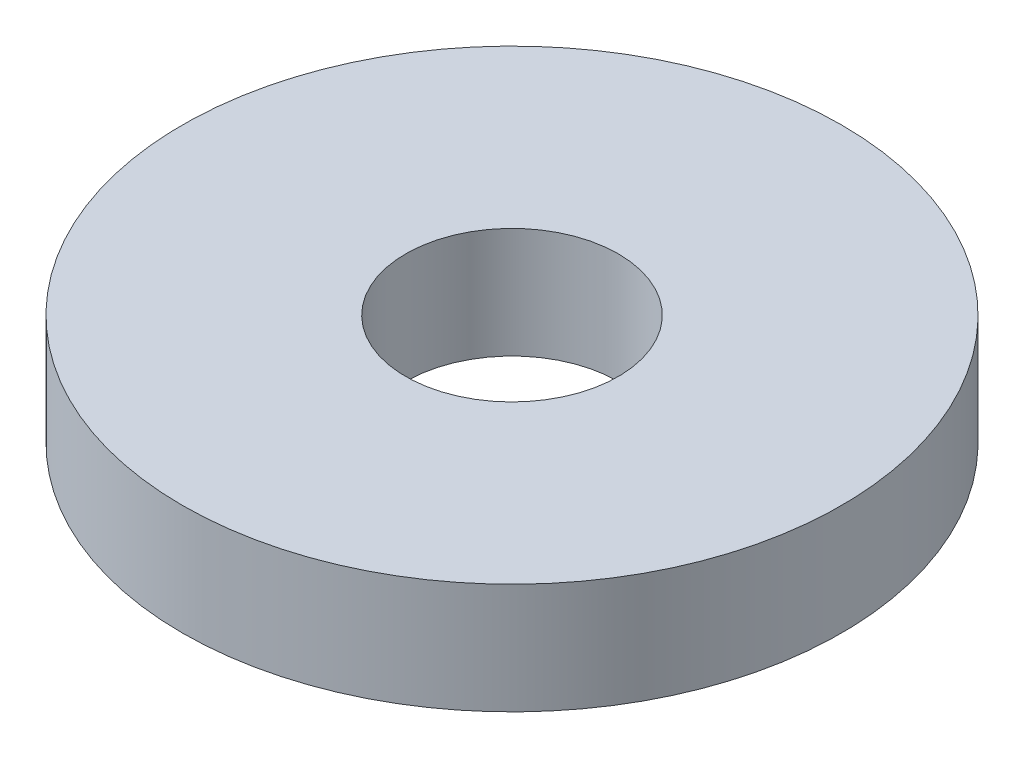
ISO-10303-21;
HEADER;
FILE_DESCRIPTION(('STEP AP214'),'2;1');
FILE_NAME('part.step','',(''),(''),'','','');
FILE_SCHEMA(('AUTOMOTIVE_DESIGN { 1 0 10303 214 1 1 1 1 }'));
ENDSEC;
DATA;
#1=APPLICATION_CONTEXT('core data for automotive mechanical design processes');
#2=APPLICATION_PROTOCOL_DEFINITION('international standard','automotive_design',2000,#1);
#3=PRODUCT_CONTEXT('',#1,'mechanical');
#4=PRODUCT('Part','Part','',(#3));
#5=PRODUCT_RELATED_PRODUCT_CATEGORY('part','',(#4));
#6=PRODUCT_DEFINITION_FORMATION('','',#4);
#7=PRODUCT_DEFINITION_CONTEXT('part definition',#1,'design');
#8=PRODUCT_DEFINITION('design','',#6,#7);
#9=PRODUCT_DEFINITION_SHAPE('','',#8);
#10=(LENGTH_UNIT() NAMED_UNIT(*) SI_UNIT(.MILLI.,.METRE.));
#11=(NAMED_UNIT(*) PLANE_ANGLE_UNIT() SI_UNIT($,.RADIAN.));
#12=(NAMED_UNIT(*) SI_UNIT($,.STERADIAN.) SOLID_ANGLE_UNIT());
#13=UNCERTAINTY_MEASURE_WITH_UNIT(LENGTH_MEASURE(1.E-05),#10,'distance_accuracy_value','');
#14=(GEOMETRIC_REPRESENTATION_CONTEXT(3) GLOBAL_UNCERTAINTY_ASSIGNED_CONTEXT((#13)) GLOBAL_UNIT_ASSIGNED_CONTEXT((#10,
#11,#12)) REPRESENTATION_CONTEXT('',''));
#15=CARTESIAN_POINT('',(0.,0.,0.));
#16=DIRECTION('',(0.,0.,1.));
#17=DIRECTION('',(1.,0.,0.));
#18=AXIS2_PLACEMENT_3D('',#15,#16,#17);
#19=CARTESIAN_POINT('',(0.,26.,0.));
#20=DIRECTION('',(0.,-1.,0.));
#21=DIRECTION('',(0.,0.,-1.));
#22=AXIS2_PLACEMENT_3D('',#19,#20,#21);
#23=CYLINDRICAL_SURFACE('',#22,77.5);
#24=CARTESIAN_POINT('',(0.,26.,0.));
#25=DIRECTION('',(0.,1.,0.));
#26=DIRECTION('',(0.,0.,1.));
#27=AXIS2_PLACEMENT_3D('',#24,#25,#26);
#28=CIRCLE('',#27,77.5);
#29=CARTESIAN_POINT('',(0.,26.,-77.5));
#30=VERTEX_POINT('',#29);
#31=EDGE_CURVE('E10',#30,#30,#28,.T.);
#32=CARTESIAN_POINT('',(0.,0.,0.));
#33=DIRECTION('',(0.,1.,0.));
#34=DIRECTION('',(0.,0.,1.));
#35=AXIS2_PLACEMENT_3D('',#32,#33,#34);
#36=CIRCLE('',#35,77.5);
#37=CARTESIAN_POINT('',(0.,0.,-77.5));
#38=VERTEX_POINT('',#37);
#39=EDGE_CURVE('E37',#38,#38,#36,.T.);
#40=CARTESIAN_POINT('',(0.,26.,-77.5));
#41=CARTESIAN_POINT('',(0.,25.7291666666667,-77.5));
#42=CARTESIAN_POINT('',(0.,25.4583333333333,-77.5));
#43=CARTESIAN_POINT('',(0.,24.9166666666667,-77.5));
#44=CARTESIAN_POINT('',(0.,24.6458333333333,-77.5));
#45=CARTESIAN_POINT('',(0.,24.1041666666667,-77.5));
#46=CARTESIAN_POINT('',(0.,23.8333333333333,-77.5));
#47=CARTESIAN_POINT('',(0.,23.2916666666667,-77.5));
#48=CARTESIAN_POINT('',(0.,23.0208333333333,-77.5));
#49=CARTESIAN_POINT('',(0.,22.4791666666667,-77.5));
#50=CARTESIAN_POINT('',(0.,22.2083333333333,-77.5));
#51=CARTESIAN_POINT('',(0.,21.6666666666667,-77.5));
#52=CARTESIAN_POINT('',(0.,21.3958333333333,-77.5));
#53=CARTESIAN_POINT('',(0.,20.8541666666667,-77.5));
#54=CARTESIAN_POINT('',(0.,20.5833333333333,-77.5));
#55=CARTESIAN_POINT('',(0.,20.0416666666667,-77.5));
#56=CARTESIAN_POINT('',(0.,19.7708333333333,-77.5));
#57=CARTESIAN_POINT('',(0.,19.2291666666667,-77.5));
#58=CARTESIAN_POINT('',(0.,18.9583333333333,-77.5));
#59=CARTESIAN_POINT('',(0.,18.4166666666667,-77.5));
#60=CARTESIAN_POINT('',(0.,18.1458333333333,-77.5));
#61=CARTESIAN_POINT('',(0.,17.6041666666667,-77.5));
#62=CARTESIAN_POINT('',(0.,17.3333333333333,-77.5));
#63=CARTESIAN_POINT('',(0.,16.7916666666667,-77.5));
#64=CARTESIAN_POINT('',(0.,16.5208333333333,-77.5));
#65=CARTESIAN_POINT('',(0.,15.9791666666667,-77.5));
#66=CARTESIAN_POINT('',(0.,15.7083333333333,-77.5));
#67=CARTESIAN_POINT('',(0.,15.1666666666667,-77.5));
#68=CARTESIAN_POINT('',(0.,14.8958333333333,-77.5));
#69=CARTESIAN_POINT('',(0.,14.3541666666667,-77.5));
#70=CARTESIAN_POINT('',(0.,14.0833333333333,-77.5));
#71=CARTESIAN_POINT('',(0.,13.5416666666667,-77.5));
#72=CARTESIAN_POINT('',(0.,13.2708333333333,-77.5));
#73=CARTESIAN_POINT('',(0.,12.7291666666667,-77.5));
#74=CARTESIAN_POINT('',(0.,12.4583333333333,-77.5));
#75=CARTESIAN_POINT('',(0.,11.9166666666667,-77.5));
#76=CARTESIAN_POINT('',(0.,11.6458333333333,-77.5));
#77=CARTESIAN_POINT('',(0.,11.1041666666667,-77.5));
#78=CARTESIAN_POINT('',(0.,10.8333333333333,-77.5));
#79=CARTESIAN_POINT('',(0.,10.2916666666667,-77.5));
#80=CARTESIAN_POINT('',(0.,10.0208333333333,-77.5));
#81=CARTESIAN_POINT('',(0.,9.47916666666667,-77.5));
#82=CARTESIAN_POINT('',(0.,9.20833333333333,-77.5));
#83=CARTESIAN_POINT('',(0.,8.66666666666667,-77.5));
#84=CARTESIAN_POINT('',(0.,8.39583333333333,-77.5));
#85=CARTESIAN_POINT('',(0.,7.85416666666667,-77.5));
#86=CARTESIAN_POINT('',(0.,7.58333333333333,-77.5));
#87=CARTESIAN_POINT('',(0.,7.04166666666667,-77.5));
#88=CARTESIAN_POINT('',(0.,6.77083333333333,-77.5));
#89=CARTESIAN_POINT('',(0.,6.22916666666667,-77.5));
#90=CARTESIAN_POINT('',(0.,5.95833333333333,-77.5));
#91=CARTESIAN_POINT('',(0.,5.41666666666667,-77.5));
#92=CARTESIAN_POINT('',(0.,5.14583333333333,-77.5));
#93=CARTESIAN_POINT('',(0.,4.60416666666667,-77.5));
#94=CARTESIAN_POINT('',(0.,4.33333333333333,-77.5));
#95=CARTESIAN_POINT('',(0.,3.79166666666667,-77.5));
#96=CARTESIAN_POINT('',(0.,3.52083333333333,-77.5));
#97=CARTESIAN_POINT('',(0.,2.97916666666667,-77.5));
#98=CARTESIAN_POINT('',(0.,2.70833333333333,-77.5));
#99=CARTESIAN_POINT('',(0.,2.16666666666667,-77.5));
#100=CARTESIAN_POINT('',(0.,1.89583333333333,-77.5));
#101=CARTESIAN_POINT('',(0.,1.35416666666667,-77.5));
#102=CARTESIAN_POINT('',(0.,1.08333333333333,-77.5));
#103=CARTESIAN_POINT('',(0.,0.541666666666667,-77.5));
#104=CARTESIAN_POINT('',(0.,0.270833333333334,-77.5));
#105=CARTESIAN_POINT('',(0.,0.,-77.5));
#106=B_SPLINE_CURVE_WITH_KNOTS('',3,(#40,#41,#42,#43,#44,#45,#46,#47,#48,#49,#50,#51,#52,#53,
#54,#55,#56,#57,#58,#59,#60,#61,#62,#63,#64,#65,#66,#67,#68,#69,#70,#71,#72,#73,#74,#75,#76,#77,
#78,#79,#80,#81,#82,#83,#84,#85,#86,#87,#88,#89,#90,#91,#92,#93,#94,#95,#96,#97,#98,#99,#100,
#101,#102,#103,#104,#105),.UNSPECIFIED.,.F.,.F.,(4,2,2,2,2,2,2,2,2,2,2,2,2,2,2,2,2,2,2,2,2,2,2,
2,2,2,2,2,2,2,2,2,4),(0.,0.812499999999997,1.625,2.4375,3.25,4.0625,4.875,5.6875,6.5,7.3125,
8.125,8.93749999999999,9.74999999999999,10.5625,11.375,12.1875,13.,13.8125,14.625,15.4375,16.25,
17.0625,17.875,18.6875,19.5,20.3125,21.125,21.9375,22.75,23.5625,24.375,25.1875,26.),.UNSPECIFIED.);
#107=EDGE_CURVE('BSEAM40',#30,#38,#106,.T.);
#108=ORIENTED_EDGE('',*,*,#31,.F.);
#109=ORIENTED_EDGE('',*,*,#39,.T.);
#110=ORIENTED_EDGE('',*,*,#107,.T.);
#111=ORIENTED_EDGE('',*,*,#107,.F.);
#112=EDGE_LOOP('',(#108,#110,#109,#111));
#113=FACE_BOUND('',#112,.T.);
#114=ADVANCED_FACE('F40',(#113),#23,.T.);
#115=CARTESIAN_POINT('',(0.,26.,0.));
#116=DIRECTION('',(0.,1.,0.));
#117=DIRECTION('',(0.,0.,1.));
#118=AXIS2_PLACEMENT_3D('',#115,#116,#117);
#119=PLANE('',#118);
#120=CARTESIAN_POINT('',(0.,26.,0.));
#121=DIRECTION('',(0.,1.,0.));
#122=DIRECTION('',(0.,0.,1.));
#123=AXIS2_PLACEMENT_3D('',#120,#121,#122);
#124=CIRCLE('',#123,25.);
#125=CARTESIAN_POINT('',(0.,26.,-25.));
#126=VERTEX_POINT('',#125);
#127=EDGE_CURVE('E50',#126,#126,#124,.T.);
#128=ORIENTED_EDGE('',*,*,#127,.F.);
#129=EDGE_LOOP('',(#128));
#130=FACE_BOUND('',#129,.T.);
#131=ORIENTED_EDGE('',*,*,#31,.T.);
#132=EDGE_LOOP('',(#131));
#133=FACE_BOUND('',#132,.T.);
#134=ADVANCED_FACE('F59',(#130,#133),#119,.T.);
#135=CARTESIAN_POINT('',(0.,0.,0.));
#136=DIRECTION('',(0.,1.,0.));
#137=DIRECTION('',(0.,0.,1.));
#138=AXIS2_PLACEMENT_3D('',#135,#136,#137);
#139=PLANE('',#138);
#140=CARTESIAN_POINT('',(0.,0.,0.));
#141=DIRECTION('',(0.,1.,0.));
#142=DIRECTION('',(0.,0.,1.));
#143=AXIS2_PLACEMENT_3D('',#140,#141,#142);
#144=CIRCLE('',#143,25.);
#145=CARTESIAN_POINT('',(0.,0.,-25.));
#146=VERTEX_POINT('',#145);
#147=EDGE_CURVE('E47',#146,#146,#144,.T.);
#148=ORIENTED_EDGE('',*,*,#147,.T.);
#149=EDGE_LOOP('',(#148));
#150=FACE_BOUND('',#149,.T.);
#151=ORIENTED_EDGE('',*,*,#39,.F.);
#152=EDGE_LOOP('',(#151));
#153=FACE_BOUND('',#152,.T.);
#154=ADVANCED_FACE('F58',(#150,#153),#139,.F.);
#155=CARTESIAN_POINT('',(0.,26.,0.));
#156=DIRECTION('',(0.,-1.,0.));
#157=DIRECTION('',(0.,0.,-1.));
#158=AXIS2_PLACEMENT_3D('',#155,#156,#157);
#159=CYLINDRICAL_SURFACE('',#158,25.);
#160=CARTESIAN_POINT('',(0.,26.,-25.));
#161=CARTESIAN_POINT('',(0.,25.7291666666667,-25.));
#162=CARTESIAN_POINT('',(0.,25.4583333333333,-25.));
#163=CARTESIAN_POINT('',(0.,24.9166666666667,-25.));
#164=CARTESIAN_POINT('',(0.,24.6458333333333,-25.));
#165=CARTESIAN_POINT('',(0.,24.1041666666667,-25.));
#166=CARTESIAN_POINT('',(0.,23.8333333333333,-25.));
#167=CARTESIAN_POINT('',(0.,23.2916666666667,-25.));
#168=CARTESIAN_POINT('',(0.,23.0208333333333,-25.));
#169=CARTESIAN_POINT('',(0.,22.4791666666667,-25.));
#170=CARTESIAN_POINT('',(0.,22.2083333333333,-25.));
#171=CARTESIAN_POINT('',(0.,21.6666666666667,-25.));
#172=CARTESIAN_POINT('',(0.,21.3958333333333,-25.));
#173=CARTESIAN_POINT('',(0.,20.8541666666667,-25.));
#174=CARTESIAN_POINT('',(0.,20.5833333333333,-25.));
#175=CARTESIAN_POINT('',(0.,20.0416666666667,-25.));
#176=CARTESIAN_POINT('',(0.,19.7708333333333,-25.));
#177=CARTESIAN_POINT('',(0.,19.2291666666667,-25.));
#178=CARTESIAN_POINT('',(0.,18.9583333333333,-25.));
#179=CARTESIAN_POINT('',(0.,18.4166666666667,-25.));
#180=CARTESIAN_POINT('',(0.,18.1458333333333,-25.));
#181=CARTESIAN_POINT('',(0.,17.6041666666667,-25.));
#182=CARTESIAN_POINT('',(0.,17.3333333333333,-25.));
#183=CARTESIAN_POINT('',(0.,16.7916666666667,-25.));
#184=CARTESIAN_POINT('',(0.,16.5208333333333,-25.));
#185=CARTESIAN_POINT('',(0.,15.9791666666667,-25.));
#186=CARTESIAN_POINT('',(0.,15.7083333333333,-25.));
#187=CARTESIAN_POINT('',(0.,15.1666666666667,-25.));
#188=CARTESIAN_POINT('',(0.,14.8958333333333,-25.));
#189=CARTESIAN_POINT('',(0.,14.3541666666667,-25.));
#190=CARTESIAN_POINT('',(0.,14.0833333333333,-25.));
#191=CARTESIAN_POINT('',(0.,13.5416666666667,-25.));
#192=CARTESIAN_POINT('',(0.,13.2708333333333,-25.));
#193=CARTESIAN_POINT('',(0.,12.7291666666667,-25.));
#194=CARTESIAN_POINT('',(0.,12.4583333333333,-25.));
#195=CARTESIAN_POINT('',(0.,11.9166666666667,-25.));
#196=CARTESIAN_POINT('',(0.,11.6458333333333,-25.));
#197=CARTESIAN_POINT('',(0.,11.1041666666667,-25.));
#198=CARTESIAN_POINT('',(0.,10.8333333333333,-25.));
#199=CARTESIAN_POINT('',(0.,10.2916666666667,-25.));
#200=CARTESIAN_POINT('',(0.,10.0208333333333,-25.));
#201=CARTESIAN_POINT('',(0.,9.47916666666667,-25.));
#202=CARTESIAN_POINT('',(0.,9.20833333333333,-25.));
#203=CARTESIAN_POINT('',(0.,8.66666666666667,-25.));
#204=CARTESIAN_POINT('',(0.,8.39583333333333,-25.));
#205=CARTESIAN_POINT('',(0.,7.85416666666667,-25.));
#206=CARTESIAN_POINT('',(0.,7.58333333333333,-25.));
#207=CARTESIAN_POINT('',(0.,7.04166666666667,-25.));
#208=CARTESIAN_POINT('',(0.,6.77083333333333,-25.));
#209=CARTESIAN_POINT('',(0.,6.22916666666667,-25.));
#210=CARTESIAN_POINT('',(0.,5.95833333333333,-25.));
#211=CARTESIAN_POINT('',(0.,5.41666666666667,-25.));
#212=CARTESIAN_POINT('',(0.,5.14583333333333,-25.));
#213=CARTESIAN_POINT('',(0.,4.60416666666667,-25.));
#214=CARTESIAN_POINT('',(0.,4.33333333333333,-25.));
#215=CARTESIAN_POINT('',(0.,3.79166666666667,-25.));
#216=CARTESIAN_POINT('',(0.,3.52083333333333,-25.));
#217=CARTESIAN_POINT('',(0.,2.97916666666667,-25.));
#218=CARTESIAN_POINT('',(0.,2.70833333333333,-25.));
#219=CARTESIAN_POINT('',(0.,2.16666666666667,-25.));
#220=CARTESIAN_POINT('',(0.,1.89583333333333,-25.));
#221=CARTESIAN_POINT('',(0.,1.35416666666667,-25.));
#222=CARTESIAN_POINT('',(0.,1.08333333333333,-25.));
#223=CARTESIAN_POINT('',(0.,0.541666666666667,-25.));
#224=CARTESIAN_POINT('',(0.,0.270833333333334,-25.));
#225=CARTESIAN_POINT('',(0.,0.,-25.));
#226=B_SPLINE_CURVE_WITH_KNOTS('',3,(#160,#161,#162,#163,#164,#165,#166,#167,#168,#169,#170,
#171,#172,#173,#174,#175,#176,#177,#178,#179,#180,#181,#182,#183,#184,#185,#186,#187,#188,#189,
#190,#191,#192,#193,#194,#195,#196,#197,#198,#199,#200,#201,#202,#203,#204,#205,#206,#207,#208,
#209,#210,#211,#212,#213,#214,#215,#216,#217,#218,#219,#220,#221,#222,#223,#224,#225),
.UNSPECIFIED.,.F.,.F.,(4,2,2,2,2,2,2,2,2,2,2,2,2,2,2,2,2,2,2,2,2,2,2,2,2,2,2,2,2,2,2,2,4),(0.,
0.812500000000001,1.625,2.4375,3.25,4.0625,4.875,5.6875,6.5,7.3125,8.125,8.9375,9.75,10.5625,
11.375,12.1875,13.,13.8125,14.625,15.4375,16.25,17.0625,17.875,18.6875,19.5,20.3125,21.125,
21.9375,22.75,23.5625,24.375,25.1875,26.),.UNSPECIFIED.);
#227=EDGE_CURVE('BSEAM54',#126,#146,#226,.T.);
#228=ORIENTED_EDGE('',*,*,#127,.T.);
#229=ORIENTED_EDGE('',*,*,#147,.F.);
#230=ORIENTED_EDGE('',*,*,#227,.T.);
#231=ORIENTED_EDGE('',*,*,#227,.F.);
#232=EDGE_LOOP('',(#228,#230,#229,#231));
#233=FACE_BOUND('',#232,.T.);
#234=ADVANCED_FACE('F54',(#233),#159,.F.);
#235=CLOSED_SHELL('',(#114,#134,#154,#234));
#236=MANIFOLD_SOLID_BREP('B2',#235);
#237=ADVANCED_BREP_SHAPE_REPRESENTATION('',(#18,#236),#14);
#238=SHAPE_DEFINITION_REPRESENTATION(#9,#237);
ENDSEC;
END-ISO-10303-21;
